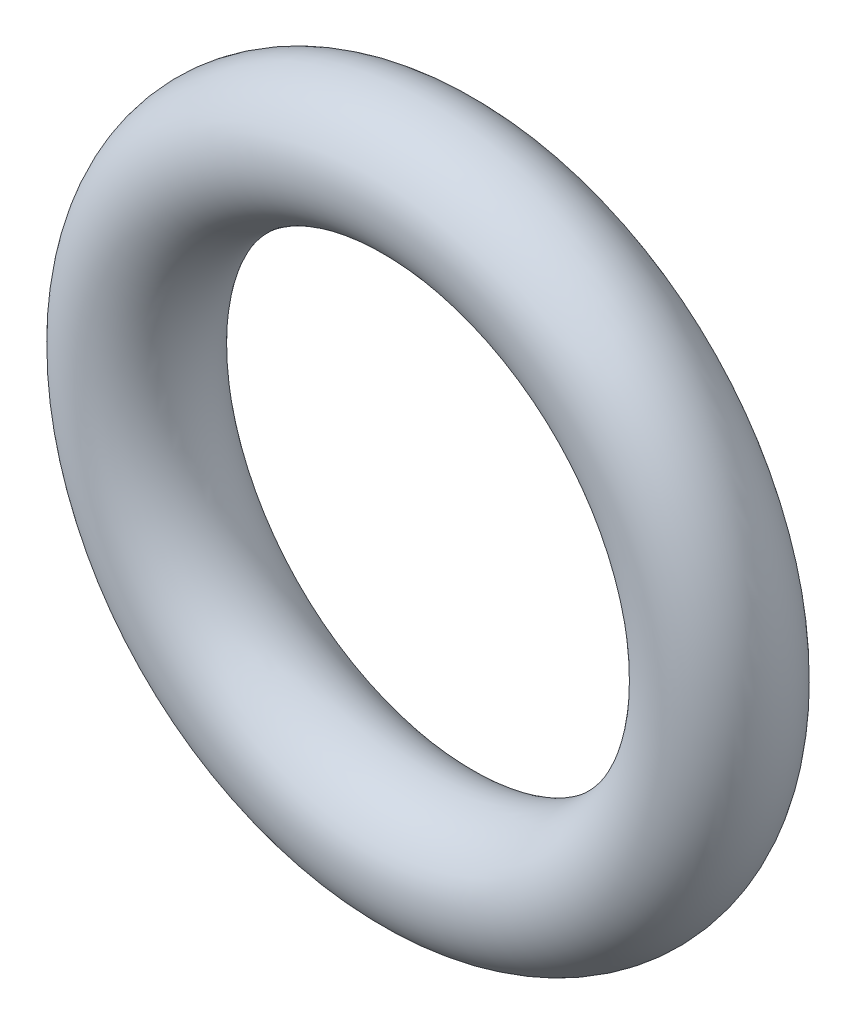
ISO-10303-21;
HEADER;
FILE_DESCRIPTION(('STEP AP214'),'2;1');
FILE_NAME('part.step','',(''),(''),'','','');
FILE_SCHEMA(('AUTOMOTIVE_DESIGN { 1 0 10303 214 1 1 1 1 }'));
ENDSEC;
DATA;
#1=APPLICATION_CONTEXT('core data for automotive mechanical design processes');
#2=APPLICATION_PROTOCOL_DEFINITION('international standard','automotive_design',2000,#1);
#3=PRODUCT_CONTEXT('',#1,'mechanical');
#4=PRODUCT('Part','Part','',(#3));
#5=PRODUCT_RELATED_PRODUCT_CATEGORY('part','',(#4));
#6=PRODUCT_DEFINITION_FORMATION('','',#4);
#7=PRODUCT_DEFINITION_CONTEXT('part definition',#1,'design');
#8=PRODUCT_DEFINITION('design','',#6,#7);
#9=PRODUCT_DEFINITION_SHAPE('','',#8);
#10=(LENGTH_UNIT() NAMED_UNIT(*) SI_UNIT(.MILLI.,.METRE.));
#11=(NAMED_UNIT(*) PLANE_ANGLE_UNIT() SI_UNIT($,.RADIAN.));
#12=(NAMED_UNIT(*) SI_UNIT($,.STERADIAN.) SOLID_ANGLE_UNIT());
#13=UNCERTAINTY_MEASURE_WITH_UNIT(LENGTH_MEASURE(1.E-05),#10,'distance_accuracy_value','');
#14=(GEOMETRIC_REPRESENTATION_CONTEXT(3) GLOBAL_UNCERTAINTY_ASSIGNED_CONTEXT((#13)) GLOBAL_UNIT_ASSIGNED_CONTEXT((#10,
#11,#12)) REPRESENTATION_CONTEXT('',''));
#15=CARTESIAN_POINT('',(0.,0.,0.));
#16=DIRECTION('',(0.,0.,1.));
#17=DIRECTION('',(1.,0.,0.));
#18=AXIS2_PLACEMENT_3D('',#15,#16,#17);
#19=CARTESIAN_POINT('',(0.,0.,0.));
#20=DIRECTION('',(0.,0.,-1.));
#21=DIRECTION('',(-1.,0.,0.));
#22=AXIS2_PLACEMENT_3D('',#19,#20,#21);
#23=TOROIDAL_SURFACE('',#22,4.35,0.95);
#24=CARTESIAN_POINT('',(-5.3,0.,0.));
#25=VERTEX_POINT('',#24);
#26=VERTEX_LOOP('',#25);
#27=FACE_BOUND('',#26,.T.);
#28=ADVANCED_FACE('F29',(#27),#23,.T.);
#29=CLOSED_SHELL('',(#28));
#30=MANIFOLD_SOLID_BREP('B2',#29);
#31=ADVANCED_BREP_SHAPE_REPRESENTATION('',(#18,#30),#14);
#32=SHAPE_DEFINITION_REPRESENTATION(#9,#31);
ENDSEC;
END-ISO-10303-21;
